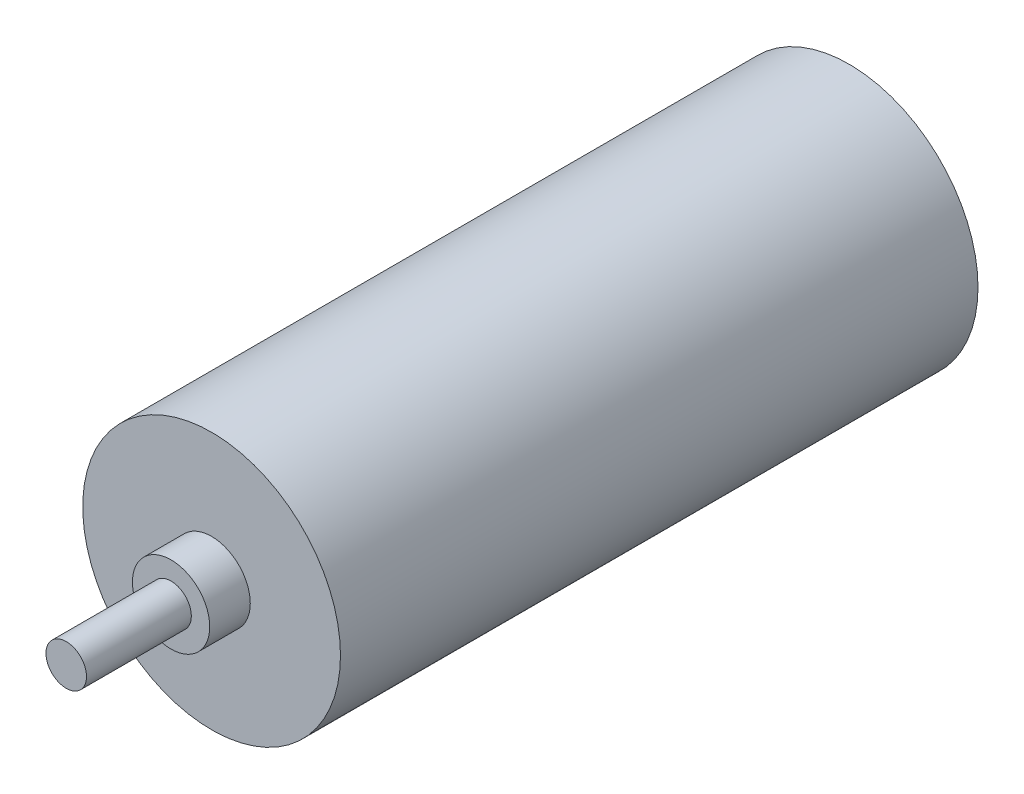
ISO-10303-21;
HEADER;
FILE_DESCRIPTION(('STEP AP214'),'2;1');
FILE_NAME('part.step','',(''),(''),'','','');
FILE_SCHEMA(('AUTOMOTIVE_DESIGN { 1 0 10303 214 1 1 1 1 }'));
ENDSEC;
DATA;
#1=APPLICATION_CONTEXT('core data for automotive mechanical design processes');
#2=APPLICATION_PROTOCOL_DEFINITION('international standard','automotive_design',2000,#1);
#3=PRODUCT_CONTEXT('',#1,'mechanical');
#4=PRODUCT('Part','Part','',(#3));
#5=PRODUCT_RELATED_PRODUCT_CATEGORY('part','',(#4));
#6=PRODUCT_DEFINITION_FORMATION('','',#4);
#7=PRODUCT_DEFINITION_CONTEXT('part definition',#1,'design');
#8=PRODUCT_DEFINITION('design','',#6,#7);
#9=PRODUCT_DEFINITION_SHAPE('','',#8);
#10=(LENGTH_UNIT() NAMED_UNIT(*) SI_UNIT(.MILLI.,.METRE.));
#11=(NAMED_UNIT(*) PLANE_ANGLE_UNIT() SI_UNIT($,.RADIAN.));
#12=(NAMED_UNIT(*) SI_UNIT($,.STERADIAN.) SOLID_ANGLE_UNIT());
#13=UNCERTAINTY_MEASURE_WITH_UNIT(LENGTH_MEASURE(1.E-05),#10,'distance_accuracy_value','');
#14=(GEOMETRIC_REPRESENTATION_CONTEXT(3) GLOBAL_UNCERTAINTY_ASSIGNED_CONTEXT((#13)) GLOBAL_UNIT_ASSIGNED_CONTEXT((#10,
#11,#12)) REPRESENTATION_CONTEXT('',''));
#15=CARTESIAN_POINT('',(0.,0.,0.));
#16=DIRECTION('',(0.,0.,1.));
#17=DIRECTION('',(1.,0.,0.));
#18=AXIS2_PLACEMENT_3D('',#15,#16,#17);
#19=CARTESIAN_POINT('',(0.,0.,94.234));
#20=DIRECTION('',(0.,0.,-1.));
#21=DIRECTION('',(-1.,0.,0.));
#22=AXIS2_PLACEMENT_3D('',#19,#20,#21);
#23=CYLINDRICAL_SURFACE('',#22,19.05);
#24=CARTESIAN_POINT('',(0.,0.,94.234));
#25=DIRECTION('',(0.,0.,1.));
#26=DIRECTION('',(1.,0.,0.));
#27=AXIS2_PLACEMENT_3D('',#24,#25,#26);
#28=CIRCLE('',#27,19.05);
#29=CARTESIAN_POINT('',(19.05,0.,94.234));
#30=VERTEX_POINT('',#29);
#31=EDGE_CURVE('E42',#30,#30,#28,.T.);
#32=ORIENTED_EDGE('',*,*,#31,.F.);
#33=EDGE_LOOP('',(#32));
#34=FACE_BOUND('',#33,.T.);
#35=CARTESIAN_POINT('',(0.,0.,0.));
#36=DIRECTION('',(0.,0.,1.));
#37=DIRECTION('',(1.,0.,0.));
#38=AXIS2_PLACEMENT_3D('',#35,#36,#37);
#39=CIRCLE('',#38,19.05);
#40=CARTESIAN_POINT('',(19.05,0.,0.));
#41=VERTEX_POINT('',#40);
#42=EDGE_CURVE('E33',#41,#41,#39,.T.);
#43=ORIENTED_EDGE('',*,*,#42,.T.);
#44=EDGE_LOOP('',(#43));
#45=FACE_BOUND('',#44,.T.);
#46=ADVANCED_FACE('F30',(#34,#45),#23,.T.);
#47=CARTESIAN_POINT('',(0.,0.,94.234));
#48=DIRECTION('',(0.,0.,1.));
#49=DIRECTION('',(1.,0.,0.));
#50=AXIS2_PLACEMENT_3D('',#47,#48,#49);
#51=PLANE('',#50);
#52=CARTESIAN_POINT('',(0.,0.,94.234));
#53=DIRECTION('',(0.,0.,1.));
#54=DIRECTION('',(1.,0.,0.));
#55=AXIS2_PLACEMENT_3D('',#52,#53,#54);
#56=CIRCLE('',#55,5.715);
#57=CARTESIAN_POINT('',(5.715,0.,94.234));
#58=VERTEX_POINT('',#57);
#59=EDGE_CURVE('E37',#58,#58,#56,.T.);
#60=ORIENTED_EDGE('',*,*,#59,.F.);
#61=EDGE_LOOP('',(#60));
#62=FACE_BOUND('',#61,.T.);
#63=ORIENTED_EDGE('',*,*,#31,.T.);
#64=EDGE_LOOP('',(#63));
#65=FACE_BOUND('',#64,.T.);
#66=ADVANCED_FACE('F59',(#62,#65),#51,.T.);
#67=CARTESIAN_POINT('',(0.,0.,0.));
#68=DIRECTION('',(0.,0.,1.));
#69=DIRECTION('',(1.,0.,0.));
#70=AXIS2_PLACEMENT_3D('',#67,#68,#69);
#71=PLANE('',#70);
#72=ORIENTED_EDGE('',*,*,#42,.F.);
#73=EDGE_LOOP('',(#72));
#74=FACE_BOUND('',#73,.T.);
#75=ADVANCED_FACE('F56',(#74),#71,.F.);
#76=CARTESIAN_POINT('',(0.,0.,100.2284));
#77=DIRECTION('',(0.,0.,-1.));
#78=DIRECTION('',(-1.,0.,0.));
#79=AXIS2_PLACEMENT_3D('',#76,#77,#78);
#80=CYLINDRICAL_SURFACE('',#79,5.715);
#81=CARTESIAN_POINT('',(0.,0.,100.2284));
#82=DIRECTION('',(0.,0.,1.));
#83=DIRECTION('',(1.,0.,0.));
#84=AXIS2_PLACEMENT_3D('',#81,#82,#83);
#85=CIRCLE('',#84,5.715);
#86=CARTESIAN_POINT('',(5.715,0.,100.2284));
#87=VERTEX_POINT('',#86);
#88=EDGE_CURVE('E47',#87,#87,#85,.T.);
#89=ORIENTED_EDGE('',*,*,#88,.F.);
#90=EDGE_LOOP('',(#89));
#91=FACE_BOUND('',#90,.T.);
#92=ORIENTED_EDGE('',*,*,#59,.T.);
#93=EDGE_LOOP('',(#92));
#94=FACE_BOUND('',#93,.T.);
#95=ADVANCED_FACE('F58',(#91,#94),#80,.T.);
#96=CARTESIAN_POINT('',(0.,0.,100.2284));
#97=DIRECTION('',(0.,0.,1.));
#98=DIRECTION('',(1.,0.,0.));
#99=AXIS2_PLACEMENT_3D('',#96,#97,#98);
#100=PLANE('',#99);
#101=CARTESIAN_POINT('',(0.,0.,100.2284));
#102=DIRECTION('',(0.,0.,1.));
#103=DIRECTION('',(1.,0.,0.));
#104=AXIS2_PLACEMENT_3D('',#101,#102,#103);
#105=CIRCLE('',#104,2.9972);
#106=CARTESIAN_POINT('',(2.9972,0.,100.2284));
#107=VERTEX_POINT('',#106);
#108=EDGE_CURVE('E10',#107,#107,#105,.T.);
#109=ORIENTED_EDGE('',*,*,#108,.F.);
#110=EDGE_LOOP('',(#109));
#111=FACE_BOUND('',#110,.T.);
#112=ORIENTED_EDGE('',*,*,#88,.T.);
#113=EDGE_LOOP('',(#112));
#114=FACE_BOUND('',#113,.T.);
#115=ADVANCED_FACE('F64',(#111,#114),#100,.T.);
#116=CARTESIAN_POINT('',(0.,0.,115.7224));
#117=DIRECTION('',(0.,0.,-1.));
#118=DIRECTION('',(-1.,0.,0.));
#119=AXIS2_PLACEMENT_3D('',#116,#117,#118);
#120=CYLINDRICAL_SURFACE('',#119,2.9972);
#121=CARTESIAN_POINT('',(0.,0.,115.7224));
#122=DIRECTION('',(0.,0.,1.));
#123=DIRECTION('',(1.,0.,0.));
#124=AXIS2_PLACEMENT_3D('',#121,#122,#123);
#125=CIRCLE('',#124,2.9972);
#126=CARTESIAN_POINT('',(2.9972,0.,115.7224));
#127=VERTEX_POINT('',#126);
#128=EDGE_CURVE('E46',#127,#127,#125,.T.);
#129=ORIENTED_EDGE('',*,*,#128,.F.);
#130=EDGE_LOOP('',(#129));
#131=FACE_BOUND('',#130,.T.);
#132=ORIENTED_EDGE('',*,*,#108,.T.);
#133=EDGE_LOOP('',(#132));
#134=FACE_BOUND('',#133,.T.);
#135=ADVANCED_FACE('F94',(#131,#134),#120,.T.);
#136=CARTESIAN_POINT('',(0.,0.,115.7224));
#137=DIRECTION('',(0.,0.,1.));
#138=DIRECTION('',(1.,0.,0.));
#139=AXIS2_PLACEMENT_3D('',#136,#137,#138);
#140=PLANE('',#139);
#141=ORIENTED_EDGE('',*,*,#128,.T.);
#142=EDGE_LOOP('',(#141));
#143=FACE_BOUND('',#142,.T.);
#144=ADVANCED_FACE('F104',(#143),#140,.T.);
#145=CLOSED_SHELL('',(#46,#66,#75,#95,#115,#135,#144));
#146=MANIFOLD_SOLID_BREP('B2',#145);
#147=ADVANCED_BREP_SHAPE_REPRESENTATION('',(#18,#146),#14);
#148=SHAPE_DEFINITION_REPRESENTATION(#9,#147);
ENDSEC;
END-ISO-10303-21;
